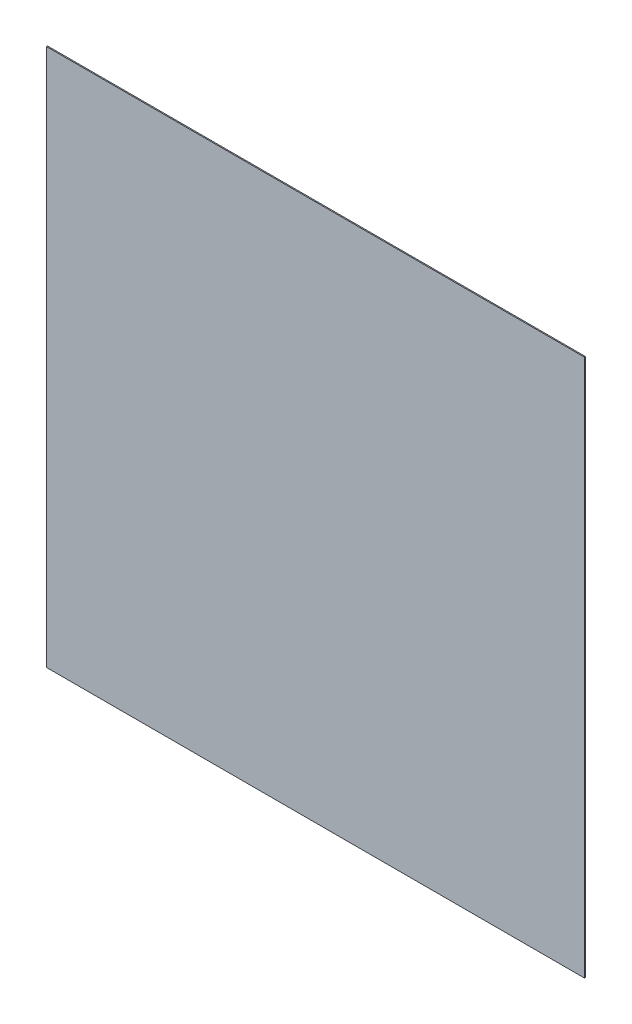
ISO-10303-21;
HEADER;
FILE_DESCRIPTION(('STEP AP214'),'2;1');
FILE_NAME('part.step','',(''),(''),'','','');
FILE_SCHEMA(('AUTOMOTIVE_DESIGN { 1 0 10303 214 1 1 1 1 }'));
ENDSEC;
DATA;
#1=APPLICATION_CONTEXT('core data for automotive mechanical design processes');
#2=APPLICATION_PROTOCOL_DEFINITION('international standard','automotive_design',2000,#1);
#3=PRODUCT_CONTEXT('',#1,'mechanical');
#4=PRODUCT('Part','Part','',(#3));
#5=PRODUCT_RELATED_PRODUCT_CATEGORY('part','',(#4));
#6=PRODUCT_DEFINITION_FORMATION('','',#4);
#7=PRODUCT_DEFINITION_CONTEXT('part definition',#1,'design');
#8=PRODUCT_DEFINITION('design','',#6,#7);
#9=PRODUCT_DEFINITION_SHAPE('','',#8);
#10=(LENGTH_UNIT() NAMED_UNIT(*) SI_UNIT(.MILLI.,.METRE.));
#11=(NAMED_UNIT(*) PLANE_ANGLE_UNIT() SI_UNIT($,.RADIAN.));
#12=(NAMED_UNIT(*) SI_UNIT($,.STERADIAN.) SOLID_ANGLE_UNIT());
#13=UNCERTAINTY_MEASURE_WITH_UNIT(LENGTH_MEASURE(1.E-05),#10,'distance_accuracy_value','');
#14=(GEOMETRIC_REPRESENTATION_CONTEXT(3) GLOBAL_UNCERTAINTY_ASSIGNED_CONTEXT((#13)) GLOBAL_UNIT_ASSIGNED_CONTEXT((#10,
#11,#12)) REPRESENTATION_CONTEXT('',''));
#15=CARTESIAN_POINT('',(0.,0.,0.));
#16=DIRECTION('',(0.,0.,1.));
#17=DIRECTION('',(1.,0.,0.));
#18=AXIS2_PLACEMENT_3D('',#15,#16,#17);
#19=CARTESIAN_POINT('',(4925.6372164685,41.409376113697,10.));
#20=DIRECTION('',(0.,-1.,0.));
#21=DIRECTION('',(0.,0.,-1.));
#22=AXIS2_PLACEMENT_3D('',#19,#20,#21);
#23=PLANE('',#22);
#24=DIRECTION('',(-1.,0.,0.));
#25=VECTOR('',#24,1.);
#26=CARTESIAN_POINT('',(4925.6372164685,41.409376113697,0.));
#27=LINE('',#26,#25);
#28=CARTESIAN_POINT('',(4925.6372164685,41.409376113697,0.));
#29=VERTEX_POINT('',#28);
#30=CARTESIAN_POINT('',(-74.3627835315039,41.409376113697,0.));
#31=VERTEX_POINT('',#30);
#32=EDGE_CURVE('E98',#29,#31,#27,.T.);
#33=ORIENTED_EDGE('',*,*,#32,.T.);
#34=DIRECTION('',(0.,0.,-1.));
#35=VECTOR('',#34,1.);
#36=CARTESIAN_POINT('',(-74.3627835315039,41.409376113697,10.));
#37=LINE('',#36,#35);
#38=CARTESIAN_POINT('',(-74.3627835315039,41.409376113697,10.));
#39=VERTEX_POINT('',#38);
#40=EDGE_CURVE('E11',#39,#31,#37,.T.);
#41=ORIENTED_EDGE('',*,*,#40,.F.);
#42=DIRECTION('',(-1.,0.,0.));
#43=VECTOR('',#42,1.);
#44=CARTESIAN_POINT('',(4925.6372164685,41.409376113697,10.));
#45=LINE('',#44,#43);
#46=CARTESIAN_POINT('',(4925.6372164685,41.409376113697,10.));
#47=VERTEX_POINT('',#46);
#48=EDGE_CURVE('E86',#47,#39,#45,.T.);
#49=ORIENTED_EDGE('',*,*,#48,.F.);
#50=DIRECTION('',(0.,0.,-1.));
#51=VECTOR('',#50,1.);
#52=CARTESIAN_POINT('',(4925.6372164685,41.409376113697,10.));
#53=LINE('',#52,#51);
#54=EDGE_CURVE('E94',#47,#29,#53,.T.);
#55=ORIENTED_EDGE('',*,*,#54,.T.);
#56=EDGE_LOOP('',(#33,#41,#49,#55));
#57=FACE_BOUND('',#56,.T.);
#58=ADVANCED_FACE('F35',(#57),#23,.F.);
#59=CARTESIAN_POINT('',(-74.3627835315039,41.409376113697,10.));
#60=DIRECTION('',(1.,0.,0.));
#61=DIRECTION('',(0.,0.,-1.));
#62=AXIS2_PLACEMENT_3D('',#59,#60,#61);
#63=PLANE('',#62);
#64=DIRECTION('',(0.,-1.,0.));
#65=VECTOR('',#64,1.);
#66=CARTESIAN_POINT('',(-74.3627835315039,41.409376113697,0.));
#67=LINE('',#66,#65);
#68=CARTESIAN_POINT('',(-74.3627835315039,-4958.5906238863,0.));
#69=VERTEX_POINT('',#68);
#70=EDGE_CURVE('E90',#31,#69,#67,.T.);
#71=ORIENTED_EDGE('',*,*,#70,.T.);
#72=DIRECTION('',(0.,0.,-1.));
#73=VECTOR('',#72,1.);
#74=CARTESIAN_POINT('',(-74.3627835315039,-4958.5906238863,10.));
#75=LINE('',#74,#73);
#76=CARTESIAN_POINT('',(-74.3627835315039,-4958.5906238863,10.));
#77=VERTEX_POINT('',#76);
#78=EDGE_CURVE('E43',#77,#69,#75,.T.);
#79=ORIENTED_EDGE('',*,*,#78,.F.);
#80=DIRECTION('',(0.,-1.,0.));
#81=VECTOR('',#80,1.);
#82=CARTESIAN_POINT('',(-74.3627835315039,41.409376113697,10.));
#83=LINE('',#82,#81);
#84=EDGE_CURVE('E81',#39,#77,#83,.T.);
#85=ORIENTED_EDGE('',*,*,#84,.F.);
#86=ORIENTED_EDGE('',*,*,#40,.T.);
#87=EDGE_LOOP('',(#71,#79,#85,#86));
#88=FACE_BOUND('',#87,.T.);
#89=ADVANCED_FACE('F89',(#88),#63,.F.);
#90=CARTESIAN_POINT('',(-74.3627835315039,-4958.5906238863,10.));
#91=DIRECTION('',(0.,1.,0.));
#92=DIRECTION('',(0.,0.,1.));
#93=AXIS2_PLACEMENT_3D('',#90,#91,#92);
#94=PLANE('',#93);
#95=DIRECTION('',(1.,0.,0.));
#96=VECTOR('',#95,1.);
#97=CARTESIAN_POINT('',(-74.3627835315039,-4958.5906238863,0.));
#98=LINE('',#97,#96);
#99=CARTESIAN_POINT('',(4925.6372164685,-4958.5906238863,0.));
#100=VERTEX_POINT('',#99);
#101=EDGE_CURVE('E68',#69,#100,#98,.T.);
#102=ORIENTED_EDGE('',*,*,#101,.T.);
#103=DIRECTION('',(0.,0.,-1.));
#104=VECTOR('',#103,1.);
#105=CARTESIAN_POINT('',(4925.6372164685,-4958.5906238863,10.));
#106=LINE('',#105,#104);
#107=CARTESIAN_POINT('',(4925.6372164685,-4958.5906238863,10.));
#108=VERTEX_POINT('',#107);
#109=EDGE_CURVE('E91',#108,#100,#106,.T.);
#110=ORIENTED_EDGE('',*,*,#109,.F.);
#111=DIRECTION('',(1.,0.,0.));
#112=VECTOR('',#111,1.);
#113=CARTESIAN_POINT('',(-74.3627835315039,-4958.5906238863,10.));
#114=LINE('',#113,#112);
#115=EDGE_CURVE('E84',#77,#108,#114,.T.);
#116=ORIENTED_EDGE('',*,*,#115,.F.);
#117=ORIENTED_EDGE('',*,*,#78,.T.);
#118=EDGE_LOOP('',(#102,#110,#116,#117));
#119=FACE_BOUND('',#118,.T.);
#120=ADVANCED_FACE('F92',(#119),#94,.F.);
#121=CARTESIAN_POINT('',(4925.6372164685,-4958.5906238863,10.));
#122=DIRECTION('',(-1.,0.,0.));
#123=DIRECTION('',(0.,0.,1.));
#124=AXIS2_PLACEMENT_3D('',#121,#122,#123);
#125=PLANE('',#124);
#126=DIRECTION('',(0.,1.,0.));
#127=VECTOR('',#126,1.);
#128=CARTESIAN_POINT('',(4925.6372164685,-4958.5906238863,0.));
#129=LINE('',#128,#127);
#130=EDGE_CURVE('E74',#100,#29,#129,.T.);
#131=ORIENTED_EDGE('',*,*,#130,.T.);
#132=ORIENTED_EDGE('',*,*,#54,.F.);
#133=DIRECTION('',(0.,1.,0.));
#134=VECTOR('',#133,1.);
#135=CARTESIAN_POINT('',(4925.6372164685,-4958.5906238863,10.));
#136=LINE('',#135,#134);
#137=EDGE_CURVE('E51',#108,#47,#136,.T.);
#138=ORIENTED_EDGE('',*,*,#137,.F.);
#139=ORIENTED_EDGE('',*,*,#109,.T.);
#140=EDGE_LOOP('',(#131,#132,#138,#139));
#141=FACE_BOUND('',#140,.T.);
#142=ADVANCED_FACE('F105',(#141),#125,.F.);
#143=CARTESIAN_POINT('',(0.,0.,10.));
#144=DIRECTION('',(0.,0.,1.));
#145=DIRECTION('',(1.,0.,0.));
#146=AXIS2_PLACEMENT_3D('',#143,#144,#145);
#147=PLANE('',#146);
#148=ORIENTED_EDGE('',*,*,#48,.T.);
#149=ORIENTED_EDGE('',*,*,#84,.T.);
#150=ORIENTED_EDGE('',*,*,#115,.T.);
#151=ORIENTED_EDGE('',*,*,#137,.T.);
#152=EDGE_LOOP('',(#148,#149,#150,#151));
#153=FACE_BOUND('',#152,.T.);
#154=ADVANCED_FACE('F82',(#153),#147,.T.);
#155=CARTESIAN_POINT('',(0.,0.,0.));
#156=DIRECTION('',(0.,0.,1.));
#157=DIRECTION('',(1.,0.,0.));
#158=AXIS2_PLACEMENT_3D('',#155,#156,#157);
#159=PLANE('',#158);
#160=ORIENTED_EDGE('',*,*,#32,.F.);
#161=ORIENTED_EDGE('',*,*,#130,.F.);
#162=ORIENTED_EDGE('',*,*,#101,.F.);
#163=ORIENTED_EDGE('',*,*,#70,.F.);
#164=EDGE_LOOP('',(#160,#161,#162,#163));
#165=FACE_BOUND('',#164,.T.);
#166=ADVANCED_FACE('F108',(#165),#159,.F.);
#167=CLOSED_SHELL('',(#58,#89,#120,#142,#154,#166));
#168=MANIFOLD_SOLID_BREP('B2',#167);
#169=ADVANCED_BREP_SHAPE_REPRESENTATION('',(#18,#168),#14);
#170=SHAPE_DEFINITION_REPRESENTATION(#9,#169);
ENDSEC;
END-ISO-10303-21;
